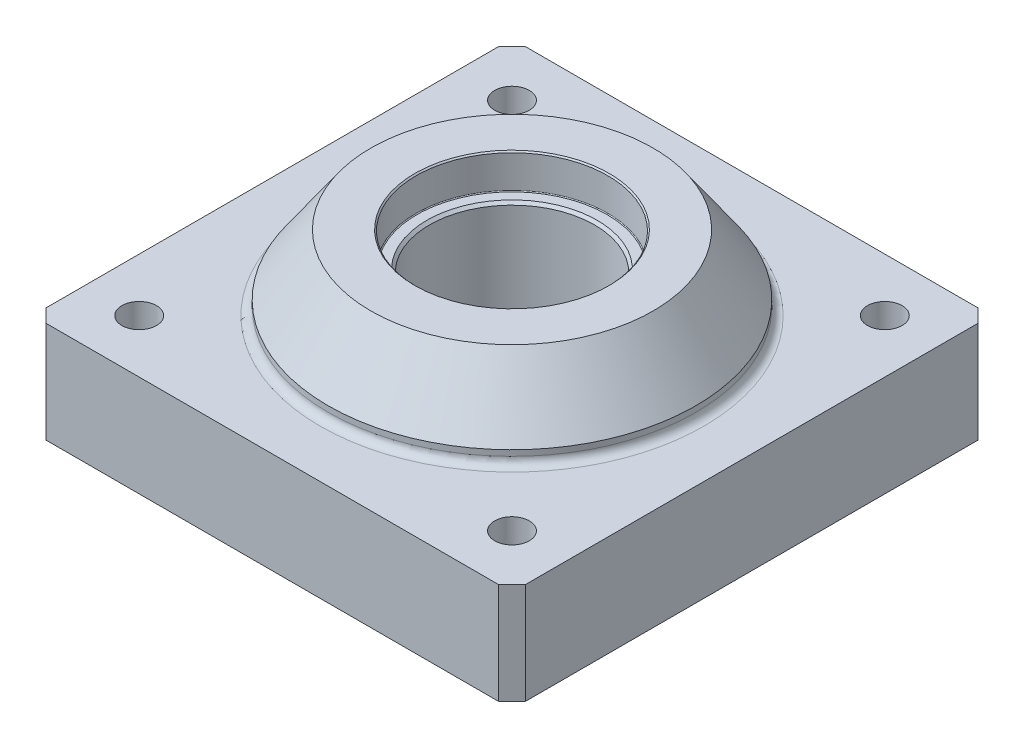
ISO-10303-21;
HEADER;
FILE_DESCRIPTION(('STEP AP214'),'2;1');
FILE_NAME('part.step','',(''),(''),'','','');
FILE_SCHEMA(('AUTOMOTIVE_DESIGN { 1 0 10303 214 1 1 1 1 }'));
ENDSEC;
DATA;
#1=APPLICATION_CONTEXT('core data for automotive mechanical design processes');
#2=APPLICATION_PROTOCOL_DEFINITION('international standard','automotive_design',2000,#1);
#3=PRODUCT_CONTEXT('',#1,'mechanical');
#4=PRODUCT('Part','Part','',(#3));
#5=PRODUCT_RELATED_PRODUCT_CATEGORY('part','',(#4));
#6=PRODUCT_DEFINITION_FORMATION('','',#4);
#7=PRODUCT_DEFINITION_CONTEXT('part definition',#1,'design');
#8=PRODUCT_DEFINITION('design','',#6,#7);
#9=PRODUCT_DEFINITION_SHAPE('','',#8);
#10=(LENGTH_UNIT() NAMED_UNIT(*) SI_UNIT(.MILLI.,.METRE.));
#11=(NAMED_UNIT(*) PLANE_ANGLE_UNIT() SI_UNIT($,.RADIAN.));
#12=(NAMED_UNIT(*) SI_UNIT($,.STERADIAN.) SOLID_ANGLE_UNIT());
#13=UNCERTAINTY_MEASURE_WITH_UNIT(LENGTH_MEASURE(1.E-05),#10,'distance_accuracy_value','');
#14=(GEOMETRIC_REPRESENTATION_CONTEXT(3) GLOBAL_UNCERTAINTY_ASSIGNED_CONTEXT((#13)) GLOBAL_UNIT_ASSIGNED_CONTEXT((#10,
#11,#12)) REPRESENTATION_CONTEXT('',''));
#15=CARTESIAN_POINT('',(0.,0.,0.));
#16=DIRECTION('',(0.,0.,1.));
#17=DIRECTION('',(1.,0.,0.));
#18=AXIS2_PLACEMENT_3D('',#15,#16,#17);
#19=CARTESIAN_POINT('',(-90.,38.,-90.));
#20=DIRECTION('',(1.,0.,0.));
#21=DIRECTION('',(0.,0.,-1.));
#22=AXIS2_PLACEMENT_3D('',#19,#20,#21);
#23=PLANE('',#22);
#24=DIRECTION('',(0.,0.,1.));
#25=VECTOR('',#24,1.);
#26=CARTESIAN_POINT('',(-90.,38.,-90.));
#27=LINE('',#26,#25);
#28=CARTESIAN_POINT('',(-90.,38.,-85.));
#29=VERTEX_POINT('',#28);
#30=CARTESIAN_POINT('',(-90.,38.,84.9999999999999));
#31=VERTEX_POINT('',#30);
#32=EDGE_CURVE('E143',#29,#31,#27,.T.);
#33=ORIENTED_EDGE('',*,*,#32,.F.);
#34=DIRECTION('',(0.,-1.,0.));
#35=VECTOR('',#34,1.);
#36=CARTESIAN_POINT('',(-90.,0.,-85.));
#37=LINE('',#36,#35);
#38=CARTESIAN_POINT('',(-90.,0.,-85.));
#39=VERTEX_POINT('',#38);
#40=EDGE_CURVE('E127',#29,#39,#37,.T.);
#41=ORIENTED_EDGE('',*,*,#40,.T.);
#42=DIRECTION('',(0.,0.,1.));
#43=VECTOR('',#42,1.);
#44=CARTESIAN_POINT('',(-90.,0.,-90.));
#45=LINE('',#44,#43);
#46=CARTESIAN_POINT('',(-90.,0.,84.9999999999999));
#47=VERTEX_POINT('',#46);
#48=EDGE_CURVE('E140',#39,#47,#45,.T.);
#49=ORIENTED_EDGE('',*,*,#48,.T.);
#50=DIRECTION('',(0.,1.,0.));
#51=VECTOR('',#50,1.);
#52=CARTESIAN_POINT('',(-90.,38.,85.));
#53=LINE('',#52,#51);
#54=EDGE_CURVE('E146',#47,#31,#53,.T.);
#55=ORIENTED_EDGE('',*,*,#54,.T.);
#56=EDGE_LOOP('',(#33,#41,#49,#55));
#57=FACE_BOUND('',#56,.T.);
#58=ADVANCED_FACE('F55',(#57),#23,.F.);
#59=CARTESIAN_POINT('',(-90.,38.,90.));
#60=DIRECTION('',(0.,0.,-1.));
#61=DIRECTION('',(-1.,0.,0.));
#62=AXIS2_PLACEMENT_3D('',#59,#60,#61);
#63=PLANE('',#62);
#64=DIRECTION('',(1.,0.,0.));
#65=VECTOR('',#64,1.);
#66=CARTESIAN_POINT('',(-90.,38.,90.));
#67=LINE('',#66,#65);
#68=CARTESIAN_POINT('',(-85.,38.,90.));
#69=VERTEX_POINT('',#68);
#70=CARTESIAN_POINT('',(84.9999999999999,38.,90.));
#71=VERTEX_POINT('',#70);
#72=EDGE_CURVE('E377',#69,#71,#67,.T.);
#73=ORIENTED_EDGE('',*,*,#72,.F.);
#74=DIRECTION('',(0.,-1.,0.));
#75=VECTOR('',#74,1.);
#76=CARTESIAN_POINT('',(-85.,38.,90.));
#77=LINE('',#76,#75);
#78=CARTESIAN_POINT('',(-85.,0.,90.));
#79=VERTEX_POINT('',#78);
#80=EDGE_CURVE('E214',#69,#79,#77,.T.);
#81=ORIENTED_EDGE('',*,*,#80,.T.);
#82=DIRECTION('',(1.,0.,0.));
#83=VECTOR('',#82,1.);
#84=CARTESIAN_POINT('',(-90.,0.,90.));
#85=LINE('',#84,#83);
#86=CARTESIAN_POINT('',(84.9999999999999,0.,90.));
#87=VERTEX_POINT('',#86);
#88=EDGE_CURVE('E152',#79,#87,#85,.T.);
#89=ORIENTED_EDGE('',*,*,#88,.T.);
#90=DIRECTION('',(0.,1.,0.));
#91=VECTOR('',#90,1.);
#92=CARTESIAN_POINT('',(85.,38.,90.));
#93=LINE('',#92,#91);
#94=EDGE_CURVE('E211',#87,#71,#93,.T.);
#95=ORIENTED_EDGE('',*,*,#94,.T.);
#96=EDGE_LOOP('',(#73,#81,#89,#95));
#97=FACE_BOUND('',#96,.T.);
#98=ADVANCED_FACE('F267',(#97),#63,.F.);
#99=CARTESIAN_POINT('',(90.,38.,-90.));
#100=DIRECTION('',(1.,0.,0.));
#101=DIRECTION('',(0.,0.,-1.));
#102=AXIS2_PLACEMENT_3D('',#99,#100,#101);
#103=PLANE('',#102);
#104=DIRECTION('',(0.,0.,1.));
#105=VECTOR('',#104,1.);
#106=CARTESIAN_POINT('',(90.,0.,-90.));
#107=LINE('',#106,#105);
#108=CARTESIAN_POINT('',(90.,0.,-85.));
#109=VERTEX_POINT('',#108);
#110=CARTESIAN_POINT('',(90.,0.,84.9999999999999));
#111=VERTEX_POINT('',#110);
#112=EDGE_CURVE('E158',#109,#111,#107,.T.);
#113=ORIENTED_EDGE('',*,*,#112,.F.);
#114=DIRECTION('',(0.,1.,0.));
#115=VECTOR('',#114,1.);
#116=CARTESIAN_POINT('',(90.,38.,-85.));
#117=LINE('',#116,#115);
#118=CARTESIAN_POINT('',(90.,38.,-85.));
#119=VERTEX_POINT('',#118);
#120=EDGE_CURVE('E78',#109,#119,#117,.T.);
#121=ORIENTED_EDGE('',*,*,#120,.T.);
#122=DIRECTION('',(0.,0.,1.));
#123=VECTOR('',#122,1.);
#124=CARTESIAN_POINT('',(90.,38.,-90.));
#125=LINE('',#124,#123);
#126=CARTESIAN_POINT('',(90.,38.,84.9999999999999));
#127=VERTEX_POINT('',#126);
#128=EDGE_CURVE('E374',#119,#127,#125,.T.);
#129=ORIENTED_EDGE('',*,*,#128,.T.);
#130=DIRECTION('',(0.,-1.,0.));
#131=VECTOR('',#130,1.);
#132=CARTESIAN_POINT('',(90.,0.,85.));
#133=LINE('',#132,#131);
#134=EDGE_CURVE('E205',#127,#111,#133,.T.);
#135=ORIENTED_EDGE('',*,*,#134,.T.);
#136=EDGE_LOOP('',(#113,#121,#129,#135));
#137=FACE_BOUND('',#136,.T.);
#138=ADVANCED_FACE('F273',(#137),#103,.T.);
#139=CARTESIAN_POINT('',(-90.,38.,-90.));
#140=DIRECTION('',(0.,0.,-1.));
#141=DIRECTION('',(-1.,0.,0.));
#142=AXIS2_PLACEMENT_3D('',#139,#140,#141);
#143=PLANE('',#142);
#144=DIRECTION('',(1.,0.,0.));
#145=VECTOR('',#144,1.);
#146=CARTESIAN_POINT('',(-90.,0.,-90.));
#147=LINE('',#146,#145);
#148=CARTESIAN_POINT('',(-85.,0.,-90.));
#149=VERTEX_POINT('',#148);
#150=CARTESIAN_POINT('',(84.9999999999999,0.,-90.));
#151=VERTEX_POINT('',#150);
#152=EDGE_CURVE('E170',#149,#151,#147,.T.);
#153=ORIENTED_EDGE('',*,*,#152,.F.);
#154=DIRECTION('',(0.,1.,0.));
#155=VECTOR('',#154,1.);
#156=CARTESIAN_POINT('',(-85.,38.,-90.));
#157=LINE('',#156,#155);
#158=CARTESIAN_POINT('',(-85.,38.,-90.));
#159=VERTEX_POINT('',#158);
#160=EDGE_CURVE('E128',#149,#159,#157,.T.);
#161=ORIENTED_EDGE('',*,*,#160,.T.);
#162=DIRECTION('',(1.,0.,0.));
#163=VECTOR('',#162,1.);
#164=CARTESIAN_POINT('',(-90.,38.,-90.));
#165=LINE('',#164,#163);
#166=CARTESIAN_POINT('',(84.9999999999999,38.,-90.));
#167=VERTEX_POINT('',#166);
#168=EDGE_CURVE('E164',#159,#167,#165,.T.);
#169=ORIENTED_EDGE('',*,*,#168,.T.);
#170=DIRECTION('',(0.,-1.,0.));
#171=VECTOR('',#170,1.);
#172=CARTESIAN_POINT('',(85.,38.,-90.));
#173=LINE('',#172,#171);
#174=EDGE_CURVE('E134',#167,#151,#173,.T.);
#175=ORIENTED_EDGE('',*,*,#174,.T.);
#176=EDGE_LOOP('',(#153,#161,#169,#175));
#177=FACE_BOUND('',#176,.T.);
#178=ADVANCED_FACE('F359',(#177),#143,.T.);
#179=CARTESIAN_POINT('',(0.,38.,0.));
#180=DIRECTION('',(0.,1.,0.));
#181=DIRECTION('',(0.,0.,1.));
#182=AXIS2_PLACEMENT_3D('',#179,#180,#181);
#183=PLANE('',#182);
#184=CARTESIAN_POINT('',(0.,38.,0.));
#185=DIRECTION('',(0.,1.,0.));
#186=DIRECTION('',(0.,0.,1.));
#187=AXIS2_PLACEMENT_3D('',#184,#185,#186);
#188=CIRCLE('',#187,72.);
#189=CARTESIAN_POINT('',(0.,38.,72.));
#190=VERTEX_POINT('',#189);
#191=EDGE_CURVE('E11',#190,#190,#188,.F.);
#192=ORIENTED_EDGE('',*,*,#191,.T.);
#193=EDGE_LOOP('',(#192));
#194=FACE_BOUND('',#193,.T.);
#195=CARTESIAN_POINT('',(-70.,38.,70.));
#196=DIRECTION('',(0.,1.,0.));
#197=DIRECTION('',(0.,0.,1.));
#198=AXIS2_PLACEMENT_3D('',#195,#196,#197);
#199=CIRCLE('',#198,6.5);
#200=CARTESIAN_POINT('',(-70.,38.,76.5));
#201=VERTEX_POINT('',#200);
#202=EDGE_CURVE('E400',#201,#201,#199,.T.);
#203=ORIENTED_EDGE('',*,*,#202,.F.);
#204=EDGE_LOOP('',(#203));
#205=FACE_BOUND('',#204,.T.);
#206=CARTESIAN_POINT('',(70.,38.,-70.));
#207=DIRECTION('',(0.,1.,0.));
#208=DIRECTION('',(0.,0.,1.));
#209=AXIS2_PLACEMENT_3D('',#206,#207,#208);
#210=CIRCLE('',#209,6.5);
#211=CARTESIAN_POINT('',(70.,38.,-63.5));
#212=VERTEX_POINT('',#211);
#213=EDGE_CURVE('E391',#212,#212,#210,.T.);
#214=ORIENTED_EDGE('',*,*,#213,.F.);
#215=EDGE_LOOP('',(#214));
#216=FACE_BOUND('',#215,.T.);
#217=CARTESIAN_POINT('',(70.,38.,70.));
#218=DIRECTION('',(0.,1.,0.));
#219=DIRECTION('',(0.,0.,1.));
#220=AXIS2_PLACEMENT_3D('',#217,#218,#219);
#221=CIRCLE('',#220,6.5);
#222=CARTESIAN_POINT('',(70.,38.,76.5));
#223=VERTEX_POINT('',#222);
#224=EDGE_CURVE('E392',#223,#223,#221,.T.);
#225=ORIENTED_EDGE('',*,*,#224,.F.);
#226=EDGE_LOOP('',(#225));
#227=FACE_BOUND('',#226,.T.);
#228=CARTESIAN_POINT('',(-70.,38.,-70.));
#229=DIRECTION('',(0.,1.,0.));
#230=DIRECTION('',(0.,0.,1.));
#231=AXIS2_PLACEMENT_3D('',#228,#229,#230);
#232=CIRCLE('',#231,6.5);
#233=CARTESIAN_POINT('',(-70.,38.,-63.5));
#234=VERTEX_POINT('',#233);
#235=EDGE_CURVE('E161',#234,#234,#232,.T.);
#236=ORIENTED_EDGE('',*,*,#235,.F.);
#237=EDGE_LOOP('',(#236));
#238=FACE_BOUND('',#237,.T.);
#239=ORIENTED_EDGE('',*,*,#168,.F.);
#240=DIRECTION('',(-0.707106781186548,0.,0.707106781186548));
#241=VECTOR('',#240,1.);
#242=CARTESIAN_POINT('',(-87.5,38.,-87.5));
#243=LINE('',#242,#241);
#244=EDGE_CURVE('E202',#159,#29,#243,.T.);
#245=ORIENTED_EDGE('',*,*,#244,.T.);
#246=ORIENTED_EDGE('',*,*,#32,.T.);
#247=DIRECTION('',(-0.707106781186548,0.,-0.707106781186548));
#248=VECTOR('',#247,1.);
#249=CARTESIAN_POINT('',(-87.5,38.,87.5));
#250=LINE('',#249,#248);
#251=EDGE_CURVE('E196',#31,#69,#250,.F.);
#252=ORIENTED_EDGE('',*,*,#251,.T.);
#253=ORIENTED_EDGE('',*,*,#72,.T.);
#254=DIRECTION('',(0.707106781186548,0.,-0.707106781186548));
#255=VECTOR('',#254,1.);
#256=CARTESIAN_POINT('',(87.5,38.,87.5));
#257=LINE('',#256,#255);
#258=EDGE_CURVE('E71',#71,#127,#257,.T.);
#259=ORIENTED_EDGE('',*,*,#258,.T.);
#260=ORIENTED_EDGE('',*,*,#128,.F.);
#261=DIRECTION('',(0.707106781186548,0.,0.707106781186548));
#262=VECTOR('',#261,1.);
#263=CARTESIAN_POINT('',(87.5,38.,-87.5));
#264=LINE('',#263,#262);
#265=EDGE_CURVE('E199',#119,#167,#264,.F.);
#266=ORIENTED_EDGE('',*,*,#265,.T.);
#267=EDGE_LOOP('',(#239,#245,#246,#252,#253,#259,#260,#266));
#268=FACE_BOUND('',#267,.T.);
#269=ADVANCED_FACE('F356',(#194,#205,#216,#227,#238,#268),#183,.T.);
#270=CARTESIAN_POINT('',(0.,0.,0.));
#271=DIRECTION('',(0.,1.,0.));
#272=DIRECTION('',(0.,0.,1.));
#273=AXIS2_PLACEMENT_3D('',#270,#271,#272);
#274=PLANE('',#273);
#275=CARTESIAN_POINT('',(0.,0.,0.));
#276=DIRECTION('',(0.,1.,0.));
#277=DIRECTION('',(0.,0.,1.));
#278=AXIS2_PLACEMENT_3D('',#275,#276,#277);
#279=CIRCLE('',#278,32.);
#280=CARTESIAN_POINT('',(0.,0.,32.));
#281=VERTEX_POINT('',#280);
#282=EDGE_CURVE('E230',#281,#281,#279,.T.);
#283=ORIENTED_EDGE('',*,*,#282,.T.);
#284=EDGE_LOOP('',(#283));
#285=FACE_BOUND('',#284,.T.);
#286=CARTESIAN_POINT('',(-70.,0.,70.));
#287=DIRECTION('',(0.,1.,0.));
#288=DIRECTION('',(0.,0.,1.));
#289=AXIS2_PLACEMENT_3D('',#286,#287,#288);
#290=CIRCLE('',#289,6.5);
#291=CARTESIAN_POINT('',(-70.,0.,76.5));
#292=VERTEX_POINT('',#291);
#293=EDGE_CURVE('E386',#292,#292,#290,.F.);
#294=ORIENTED_EDGE('',*,*,#293,.F.);
#295=EDGE_LOOP('',(#294));
#296=FACE_BOUND('',#295,.T.);
#297=CARTESIAN_POINT('',(70.,0.,-70.));
#298=DIRECTION('',(0.,1.,0.));
#299=DIRECTION('',(0.,0.,1.));
#300=AXIS2_PLACEMENT_3D('',#297,#298,#299);
#301=CIRCLE('',#300,6.5);
#302=CARTESIAN_POINT('',(70.,0.,-63.5));
#303=VERTEX_POINT('',#302);
#304=EDGE_CURVE('E396',#303,#303,#301,.F.);
#305=ORIENTED_EDGE('',*,*,#304,.F.);
#306=EDGE_LOOP('',(#305));
#307=FACE_BOUND('',#306,.T.);
#308=CARTESIAN_POINT('',(70.,0.,70.));
#309=DIRECTION('',(0.,1.,0.));
#310=DIRECTION('',(0.,0.,1.));
#311=AXIS2_PLACEMENT_3D('',#308,#309,#310);
#312=CIRCLE('',#311,6.5);
#313=CARTESIAN_POINT('',(70.,0.,76.5));
#314=VERTEX_POINT('',#313);
#315=EDGE_CURVE('E387',#314,#314,#312,.F.);
#316=ORIENTED_EDGE('',*,*,#315,.F.);
#317=EDGE_LOOP('',(#316));
#318=FACE_BOUND('',#317,.T.);
#319=CARTESIAN_POINT('',(-70.,0.,-70.));
#320=DIRECTION('',(0.,1.,0.));
#321=DIRECTION('',(0.,0.,1.));
#322=AXIS2_PLACEMENT_3D('',#319,#320,#321);
#323=CIRCLE('',#322,6.5);
#324=CARTESIAN_POINT('',(-70.,0.,-63.5));
#325=VERTEX_POINT('',#324);
#326=EDGE_CURVE('E153',#325,#325,#323,.F.);
#327=ORIENTED_EDGE('',*,*,#326,.F.);
#328=EDGE_LOOP('',(#327));
#329=FACE_BOUND('',#328,.T.);
#330=ORIENTED_EDGE('',*,*,#48,.F.);
#331=DIRECTION('',(0.707106781186548,0.,-0.707106781186548));
#332=VECTOR('',#331,1.);
#333=CARTESIAN_POINT('',(-90.,0.,-85.));
#334=LINE('',#333,#332);
#335=EDGE_CURVE('E123',#39,#149,#334,.T.);
#336=ORIENTED_EDGE('',*,*,#335,.T.);
#337=ORIENTED_EDGE('',*,*,#152,.T.);
#338=DIRECTION('',(-0.707106781186548,0.,-0.707106781186548));
#339=VECTOR('',#338,1.);
#340=CARTESIAN_POINT('',(85.,0.,-90.));
#341=LINE('',#340,#339);
#342=EDGE_CURVE('E135',#151,#109,#341,.F.);
#343=ORIENTED_EDGE('',*,*,#342,.T.);
#344=ORIENTED_EDGE('',*,*,#112,.T.);
#345=DIRECTION('',(-0.707106781186548,0.,0.707106781186548));
#346=VECTOR('',#345,1.);
#347=CARTESIAN_POINT('',(90.,0.,85.));
#348=LINE('',#347,#346);
#349=EDGE_CURVE('E145',#111,#87,#348,.T.);
#350=ORIENTED_EDGE('',*,*,#349,.T.);
#351=ORIENTED_EDGE('',*,*,#88,.F.);
#352=DIRECTION('',(0.707106781186548,0.,0.707106781186548));
#353=VECTOR('',#352,1.);
#354=CARTESIAN_POINT('',(-85.,0.,90.));
#355=LINE('',#354,#353);
#356=EDGE_CURVE('E150',#79,#47,#355,.F.);
#357=ORIENTED_EDGE('',*,*,#356,.T.);
#358=EDGE_LOOP('',(#330,#336,#337,#343,#344,#350,#351,#357));
#359=FACE_BOUND('',#358,.T.);
#360=ADVANCED_FACE('F148',(#285,#296,#307,#318,#329,#359),#274,.F.);
#361=CARTESIAN_POINT('',(0.,66.,0.));
#362=DIRECTION('',(0.,-1.,0.));
#363=DIRECTION('',(0.,0.,-1.));
#364=AXIS2_PLACEMENT_3D('',#361,#362,#363);
#365=CYLINDRICAL_SURFACE('',#364,69.);
#366=CARTESIAN_POINT('',(0.,41.,0.));
#367=DIRECTION('',(0.,1.,0.));
#368=DIRECTION('',(0.,0.,1.));
#369=AXIS2_PLACEMENT_3D('',#366,#367,#368);
#370=CIRCLE('',#369,69.);
#371=CARTESIAN_POINT('',(0.,41.,69.));
#372=VERTEX_POINT('',#371);
#373=EDGE_CURVE('E64',#372,#372,#370,.T.);
#374=ORIENTED_EDGE('',*,*,#373,.T.);
#375=EDGE_LOOP('',(#374));
#376=FACE_BOUND('',#375,.T.);
#377=CARTESIAN_POINT('',(0.,43.1496318921261,0.));
#378=DIRECTION('',(0.,1.,0.));
#379=DIRECTION('',(0.,0.,1.));
#380=AXIS2_PLACEMENT_3D('',#377,#378,#379);
#381=CIRCLE('',#380,69.);
#382=CARTESIAN_POINT('',(0.,43.1496318921261,69.));
#383=VERTEX_POINT('',#382);
#384=EDGE_CURVE('E177',#383,#383,#381,.F.);
#385=ORIENTED_EDGE('',*,*,#384,.T.);
#386=EDGE_LOOP('',(#385));
#387=FACE_BOUND('',#386,.T.);
#388=ADVANCED_FACE('F253',(#376,#387),#365,.T.);
#389=CARTESIAN_POINT('',(0.,66.,0.));
#390=DIRECTION('',(0.,1.,0.));
#391=DIRECTION('',(0.,0.,1.));
#392=AXIS2_PLACEMENT_3D('',#389,#390,#391);
#393=PLANE('',#392);
#394=CARTESIAN_POINT('',(0.,66.,0.));
#395=DIRECTION('',(0.,1.,0.));
#396=DIRECTION('',(0.,0.,1.));
#397=AXIS2_PLACEMENT_3D('',#394,#395,#396);
#398=CIRCLE('',#397,36.5);
#399=CARTESIAN_POINT('',(0.,66.,36.5));
#400=VERTEX_POINT('',#399);
#401=EDGE_CURVE('E238',#400,#400,#398,.F.);
#402=ORIENTED_EDGE('',*,*,#401,.T.);
#403=EDGE_LOOP('',(#402));
#404=FACE_BOUND('',#403,.T.);
#405=CARTESIAN_POINT('',(0.,66.,0.));
#406=DIRECTION('',(0.,1.,0.));
#407=DIRECTION('',(0.,0.,1.));
#408=AXIS2_PLACEMENT_3D('',#405,#406,#407);
#409=CIRCLE('',#408,52.9999999999999);
#410=CARTESIAN_POINT('',(0.,66.,52.9999999999999));
#411=VERTEX_POINT('',#410);
#412=EDGE_CURVE('E173',#411,#411,#409,.T.);
#413=ORIENTED_EDGE('',*,*,#412,.T.);
#414=EDGE_LOOP('',(#413));
#415=FACE_BOUND('',#414,.T.);
#416=ADVANCED_FACE('F286',(#404,#415),#393,.T.);
#417=CARTESIAN_POINT('',(0.,66.,0.));
#418=DIRECTION('',(0.,-1.,0.));
#419=DIRECTION('',(0.,0.,-1.));
#420=AXIS2_PLACEMENT_3D('',#417,#418,#419);
#421=CONICAL_SURFACE('',#420,52.9999999999999,0.610865238198017);
#422=ORIENTED_EDGE('',*,*,#384,.F.);
#423=EDGE_LOOP('',(#422));
#424=FACE_BOUND('',#423,.T.);
#425=ORIENTED_EDGE('',*,*,#412,.F.);
#426=EDGE_LOOP('',(#425));
#427=FACE_BOUND('',#426,.T.);
#428=ADVANCED_FACE('F279',(#424,#427),#421,.T.);
#429=CARTESIAN_POINT('',(0.,53.,0.));
#430=DIRECTION('',(0.,1.,0.));
#431=DIRECTION('',(0.,0.,1.));
#432=AXIS2_PLACEMENT_3D('',#429,#430,#431);
#433=CYLINDRICAL_SURFACE('',#432,36.);
#434=CARTESIAN_POINT('',(0.,53.3,0.));
#435=DIRECTION('',(0.,1.,0.));
#436=DIRECTION('',(0.,0.,1.));
#437=AXIS2_PLACEMENT_3D('',#434,#435,#436);
#438=CIRCLE('',#437,36.);
#439=CARTESIAN_POINT('',(0.,53.3,36.));
#440=VERTEX_POINT('',#439);
#441=EDGE_CURVE('E246',#440,#440,#438,.F.);
#442=ORIENTED_EDGE('',*,*,#441,.T.);
#443=EDGE_LOOP('',(#442));
#444=FACE_BOUND('',#443,.T.);
#445=CARTESIAN_POINT('',(0.,65.4999999999999,0.));
#446=DIRECTION('',(0.,1.,0.));
#447=DIRECTION('',(0.,0.,1.));
#448=AXIS2_PLACEMENT_3D('',#445,#446,#447);
#449=CIRCLE('',#448,36.);
#450=CARTESIAN_POINT('',(0.,65.4999999999999,36.));
#451=VERTEX_POINT('',#450);
#452=EDGE_CURVE('E234',#451,#451,#449,.T.);
#453=ORIENTED_EDGE('',*,*,#452,.T.);
#454=EDGE_LOOP('',(#453));
#455=FACE_BOUND('',#454,.T.);
#456=ADVANCED_FACE('F285',(#444,#455),#433,.F.);
#457=CARTESIAN_POINT('',(0.,53.,0.));
#458=DIRECTION('',(0.,1.,0.));
#459=DIRECTION('',(0.,0.,1.));
#460=AXIS2_PLACEMENT_3D('',#457,#458,#459);
#461=PLANE('',#460);
#462=CARTESIAN_POINT('',(0.,53.,0.));
#463=DIRECTION('',(0.,1.,0.));
#464=DIRECTION('',(0.,0.,1.));
#465=AXIS2_PLACEMENT_3D('',#462,#463,#464);
#466=CIRCLE('',#465,35.7);
#467=CARTESIAN_POINT('',(0.,53.,35.7));
#468=VERTEX_POINT('',#467);
#469=EDGE_CURVE('E242',#468,#468,#466,.T.);
#470=ORIENTED_EDGE('',*,*,#469,.T.);
#471=EDGE_LOOP('',(#470));
#472=FACE_BOUND('',#471,.T.);
#473=CARTESIAN_POINT('',(0.,53.,0.));
#474=DIRECTION('',(0.,1.,0.));
#475=DIRECTION('',(0.,0.,1.));
#476=AXIS2_PLACEMENT_3D('',#473,#474,#475);
#477=CIRCLE('',#476,32.);
#478=CARTESIAN_POINT('',(0.,53.,32.));
#479=VERTEX_POINT('',#478);
#480=EDGE_CURVE('E218',#479,#479,#477,.F.);
#481=ORIENTED_EDGE('',*,*,#480,.T.);
#482=EDGE_LOOP('',(#481));
#483=FACE_BOUND('',#482,.T.);
#484=ADVANCED_FACE('F340',(#472,#483),#461,.T.);
#485=CARTESIAN_POINT('',(0.,66.001,0.));
#486=DIRECTION('',(0.,-1.,0.));
#487=DIRECTION('',(0.,0.,-1.));
#488=AXIS2_PLACEMENT_3D('',#485,#486,#487);
#489=CYLINDRICAL_SURFACE('',#488,31.);
#490=CARTESIAN_POINT('',(0.,52.0000000000001,0.));
#491=DIRECTION('',(0.,1.,0.));
#492=DIRECTION('',(0.,0.,1.));
#493=AXIS2_PLACEMENT_3D('',#490,#491,#492);
#494=CIRCLE('',#493,31.);
#495=CARTESIAN_POINT('',(0.,52.0000000000001,31.));
#496=VERTEX_POINT('',#495);
#497=EDGE_CURVE('E226',#496,#496,#494,.T.);
#498=ORIENTED_EDGE('',*,*,#497,.T.);
#499=EDGE_LOOP('',(#498));
#500=FACE_BOUND('',#499,.T.);
#501=CARTESIAN_POINT('',(0.,1.00000000000003,0.));
#502=DIRECTION('',(0.,1.,0.));
#503=DIRECTION('',(0.,0.,1.));
#504=AXIS2_PLACEMENT_3D('',#501,#502,#503);
#505=CIRCLE('',#504,31.);
#506=CARTESIAN_POINT('',(0.,1.00000000000003,31.));
#507=VERTEX_POINT('',#506);
#508=EDGE_CURVE('E222',#507,#507,#505,.F.);
#509=ORIENTED_EDGE('',*,*,#508,.T.);
#510=EDGE_LOOP('',(#509));
#511=FACE_BOUND('',#510,.T.);
#512=ADVANCED_FACE('F346',(#500,#511),#489,.F.);
#513=CARTESIAN_POINT('',(-70.,-0.001000000000001,-70.));
#514=DIRECTION('',(0.,1.,0.));
#515=DIRECTION('',(0.,0.,1.));
#516=AXIS2_PLACEMENT_3D('',#513,#514,#515);
#517=CYLINDRICAL_SURFACE('',#516,6.5);
#518=ORIENTED_EDGE('',*,*,#235,.T.);
#519=EDGE_LOOP('',(#518));
#520=FACE_BOUND('',#519,.T.);
#521=ORIENTED_EDGE('',*,*,#326,.T.);
#522=EDGE_LOOP('',(#521));
#523=FACE_BOUND('',#522,.T.);
#524=ADVANCED_FACE('F420',(#520,#523),#517,.F.);
#525=CARTESIAN_POINT('',(70.,-0.001000000000001,70.));
#526=DIRECTION('',(0.,1.,0.));
#527=DIRECTION('',(0.,0.,1.));
#528=AXIS2_PLACEMENT_3D('',#525,#526,#527);
#529=CYLINDRICAL_SURFACE('',#528,6.5);
#530=ORIENTED_EDGE('',*,*,#224,.T.);
#531=EDGE_LOOP('',(#530));
#532=FACE_BOUND('',#531,.T.);
#533=ORIENTED_EDGE('',*,*,#315,.T.);
#534=EDGE_LOOP('',(#533));
#535=FACE_BOUND('',#534,.T.);
#536=ADVANCED_FACE('F423',(#532,#535),#529,.F.);
#537=CARTESIAN_POINT('',(70.,-0.001000000000001,-70.));
#538=DIRECTION('',(0.,1.,0.));
#539=DIRECTION('',(0.,0.,1.));
#540=AXIS2_PLACEMENT_3D('',#537,#538,#539);
#541=CYLINDRICAL_SURFACE('',#540,6.5);
#542=ORIENTED_EDGE('',*,*,#213,.T.);
#543=EDGE_LOOP('',(#542));
#544=FACE_BOUND('',#543,.T.);
#545=ORIENTED_EDGE('',*,*,#304,.T.);
#546=EDGE_LOOP('',(#545));
#547=FACE_BOUND('',#546,.T.);
#548=ADVANCED_FACE('F431',(#544,#547),#541,.F.);
#549=CARTESIAN_POINT('',(-70.,-0.001000000000001,70.));
#550=DIRECTION('',(0.,1.,0.));
#551=DIRECTION('',(0.,0.,1.));
#552=AXIS2_PLACEMENT_3D('',#549,#550,#551);
#553=CYLINDRICAL_SURFACE('',#552,6.5);
#554=ORIENTED_EDGE('',*,*,#202,.T.);
#555=EDGE_LOOP('',(#554));
#556=FACE_BOUND('',#555,.T.);
#557=ORIENTED_EDGE('',*,*,#293,.T.);
#558=EDGE_LOOP('',(#557));
#559=FACE_BOUND('',#558,.T.);
#560=ADVANCED_FACE('F294',(#556,#559),#553,.F.);
#561=CARTESIAN_POINT('',(-90.,38.,-85.));
#562=DIRECTION('',(-0.707106781186547,0.,-0.707106781186547));
#563=DIRECTION('',(0.,1.,0.));
#564=AXIS2_PLACEMENT_3D('',#561,#562,#563);
#565=PLANE('',#564);
#566=ORIENTED_EDGE('',*,*,#244,.F.);
#567=ORIENTED_EDGE('',*,*,#160,.F.);
#568=ORIENTED_EDGE('',*,*,#335,.F.);
#569=ORIENTED_EDGE('',*,*,#40,.F.);
#570=EDGE_LOOP('',(#566,#567,#568,#569));
#571=FACE_BOUND('',#570,.T.);
#572=ADVANCED_FACE('F126',(#571),#565,.T.);
#573=CARTESIAN_POINT('',(85.,38.,-90.));
#574=DIRECTION('',(-0.707106781186547,0.,0.707106781186547));
#575=DIRECTION('',(0.,-1.,0.));
#576=AXIS2_PLACEMENT_3D('',#573,#574,#575);
#577=PLANE('',#576);
#578=ORIENTED_EDGE('',*,*,#265,.F.);
#579=ORIENTED_EDGE('',*,*,#120,.F.);
#580=ORIENTED_EDGE('',*,*,#342,.F.);
#581=ORIENTED_EDGE('',*,*,#174,.F.);
#582=EDGE_LOOP('',(#578,#579,#580,#581));
#583=FACE_BOUND('',#582,.T.);
#584=ADVANCED_FACE('F293',(#583),#577,.F.);
#585=CARTESIAN_POINT('',(-85.,38.,90.));
#586=DIRECTION('',(0.707106781186547,0.,-0.707106781186547));
#587=DIRECTION('',(0.,-1.,0.));
#588=AXIS2_PLACEMENT_3D('',#585,#586,#587);
#589=PLANE('',#588);
#590=ORIENTED_EDGE('',*,*,#251,.F.);
#591=ORIENTED_EDGE('',*,*,#54,.F.);
#592=ORIENTED_EDGE('',*,*,#356,.F.);
#593=ORIENTED_EDGE('',*,*,#80,.F.);
#594=EDGE_LOOP('',(#590,#591,#592,#593));
#595=FACE_BOUND('',#594,.T.);
#596=ADVANCED_FACE('F300',(#595),#589,.F.);
#597=CARTESIAN_POINT('',(90.,38.,85.));
#598=DIRECTION('',(0.707106781186547,0.,0.707106781186547));
#599=DIRECTION('',(0.,1.,0.));
#600=AXIS2_PLACEMENT_3D('',#597,#598,#599);
#601=PLANE('',#600);
#602=ORIENTED_EDGE('',*,*,#258,.F.);
#603=ORIENTED_EDGE('',*,*,#94,.F.);
#604=ORIENTED_EDGE('',*,*,#349,.F.);
#605=ORIENTED_EDGE('',*,*,#134,.F.);
#606=EDGE_LOOP('',(#602,#603,#604,#605));
#607=FACE_BOUND('',#606,.T.);
#608=ADVANCED_FACE('F307',(#607),#601,.T.);
#609=CARTESIAN_POINT('',(0.,53.,0.));
#610=DIRECTION('',(0.,1.,0.));
#611=DIRECTION('',(0.,0.,1.));
#612=AXIS2_PLACEMENT_3D('',#609,#610,#611);
#613=CONICAL_SURFACE('',#612,32.,0.785398163397462);
#614=ORIENTED_EDGE('',*,*,#497,.F.);
#615=EDGE_LOOP('',(#614));
#616=FACE_BOUND('',#615,.T.);
#617=ORIENTED_EDGE('',*,*,#480,.F.);
#618=EDGE_LOOP('',(#617));
#619=FACE_BOUND('',#618,.T.);
#620=ADVANCED_FACE('F314',(#616,#619),#613,.F.);
#621=CARTESIAN_POINT('',(0.,1.00000000000003,0.));
#622=DIRECTION('',(0.,-1.,0.));
#623=DIRECTION('',(0.,0.,-1.));
#624=AXIS2_PLACEMENT_3D('',#621,#622,#623);
#625=CONICAL_SURFACE('',#624,31.,0.785398163397448);
#626=ORIENTED_EDGE('',*,*,#282,.F.);
#627=EDGE_LOOP('',(#626));
#628=FACE_BOUND('',#627,.T.);
#629=ORIENTED_EDGE('',*,*,#508,.F.);
#630=EDGE_LOOP('',(#629));
#631=FACE_BOUND('',#630,.T.);
#632=ADVANCED_FACE('F321',(#628,#631),#625,.F.);
#633=CARTESIAN_POINT('',(0.,65.4999999999999,0.));
#634=DIRECTION('',(0.,1.,0.));
#635=DIRECTION('',(0.,0.,1.));
#636=AXIS2_PLACEMENT_3D('',#633,#634,#635);
#637=CONICAL_SURFACE('',#636,36.,0.785398163397435);
#638=ORIENTED_EDGE('',*,*,#401,.F.);
#639=EDGE_LOOP('',(#638));
#640=FACE_BOUND('',#639,.T.);
#641=ORIENTED_EDGE('',*,*,#452,.F.);
#642=EDGE_LOOP('',(#641));
#643=FACE_BOUND('',#642,.T.);
#644=ADVANCED_FACE('F263',(#640,#643),#637,.F.);
#645=CARTESIAN_POINT('',(0.,53.3,0.));
#646=DIRECTION('',(0.,1.,0.));
#647=DIRECTION('',(0.,0.,1.));
#648=AXIS2_PLACEMENT_3D('',#645,#646,#647);
#649=TOROIDAL_SURFACE('',#648,35.7,0.3);
#650=ORIENTED_EDGE('',*,*,#441,.F.);
#651=EDGE_LOOP('',(#650));
#652=FACE_BOUND('',#651,.T.);
#653=ORIENTED_EDGE('',*,*,#469,.F.);
#654=EDGE_LOOP('',(#653));
#655=FACE_BOUND('',#654,.T.);
#656=ADVANCED_FACE('F257',(#652,#655),#649,.F.);
#657=CARTESIAN_POINT('',(0.,41.,0.));
#658=DIRECTION('',(0.,1.,0.));
#659=DIRECTION('',(0.,0.,1.));
#660=AXIS2_PLACEMENT_3D('',#657,#658,#659);
#661=TOROIDAL_SURFACE('',#660,72.,3.);
#662=ORIENTED_EDGE('',*,*,#191,.F.);
#663=EDGE_LOOP('',(#662));
#664=FACE_BOUND('',#663,.T.);
#665=ORIENTED_EDGE('',*,*,#373,.F.);
#666=EDGE_LOOP('',(#665));
#667=FACE_BOUND('',#666,.T.);
#668=ADVANCED_FACE('F57',(#664,#667),#661,.F.);
#669=CLOSED_SHELL('',(#58,#98,#138,#178,#269,#360,#388,#416,#428,#456,#484,#512,#524,#536,#548,
#560,#572,#584,#596,#608,#620,#632,#644,#656,#668));
#670=MANIFOLD_SOLID_BREP('B2',#669);
#671=ADVANCED_BREP_SHAPE_REPRESENTATION('',(#18,#670),#14);
#672=SHAPE_DEFINITION_REPRESENTATION(#9,#671);
ENDSEC;
END-ISO-10303-21;
